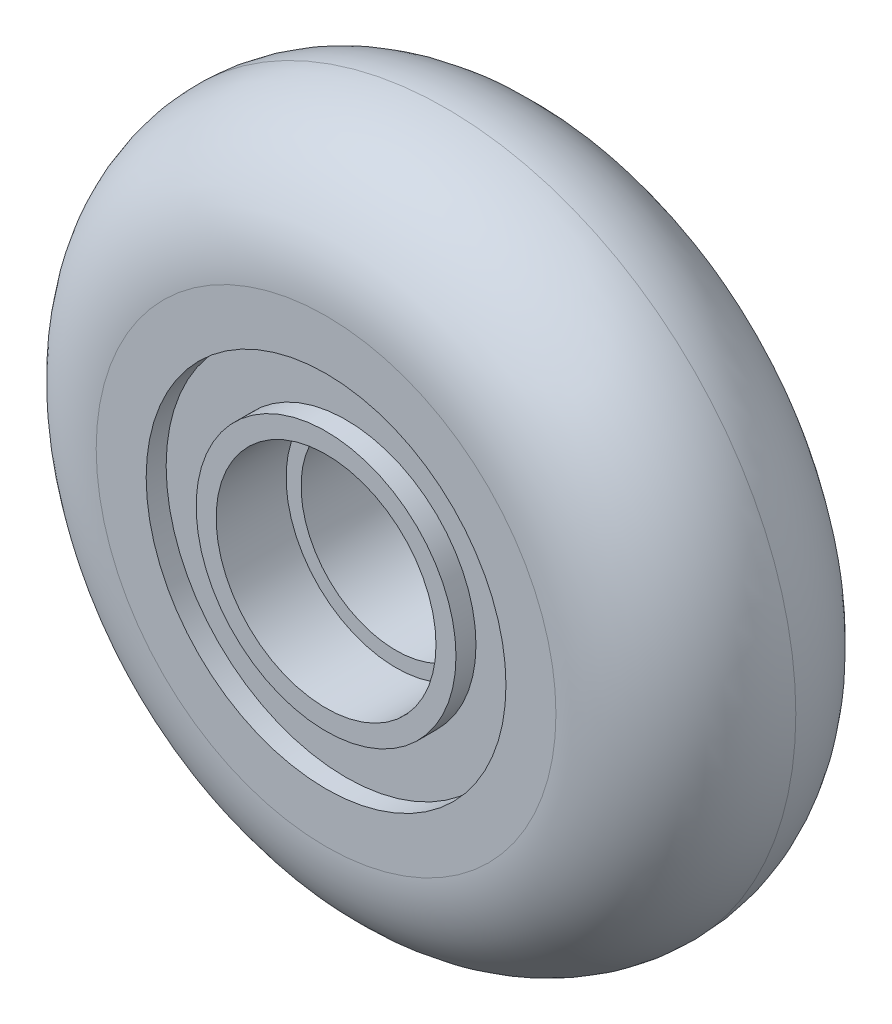
ISO-10303-21;
HEADER;
FILE_DESCRIPTION(('STEP AP214'),'2;1');
FILE_NAME('part.step','',(''),(''),'','','');
FILE_SCHEMA(('AUTOMOTIVE_DESIGN { 1 0 10303 214 1 1 1 1 }'));
ENDSEC;
DATA;
#1=APPLICATION_CONTEXT('core data for automotive mechanical design processes');
#2=APPLICATION_PROTOCOL_DEFINITION('international standard','automotive_design',2000,#1);
#3=PRODUCT_CONTEXT('',#1,'mechanical');
#4=PRODUCT('Part','Part','',(#3));
#5=PRODUCT_RELATED_PRODUCT_CATEGORY('part','',(#4));
#6=PRODUCT_DEFINITION_FORMATION('','',#4);
#7=PRODUCT_DEFINITION_CONTEXT('part definition',#1,'design');
#8=PRODUCT_DEFINITION('design','',#6,#7);
#9=PRODUCT_DEFINITION_SHAPE('','',#8);
#10=(LENGTH_UNIT() NAMED_UNIT(*) SI_UNIT(.MILLI.,.METRE.));
#11=(NAMED_UNIT(*) PLANE_ANGLE_UNIT() SI_UNIT($,.RADIAN.));
#12=(NAMED_UNIT(*) SI_UNIT($,.STERADIAN.) SOLID_ANGLE_UNIT());
#13=UNCERTAINTY_MEASURE_WITH_UNIT(LENGTH_MEASURE(1.E-05),#10,'distance_accuracy_value','');
#14=(GEOMETRIC_REPRESENTATION_CONTEXT(3) GLOBAL_UNCERTAINTY_ASSIGNED_CONTEXT((#13)) GLOBAL_UNIT_ASSIGNED_CONTEXT((#10,
#11,#12)) REPRESENTATION_CONTEXT('',''));
#15=CARTESIAN_POINT('',(0.,0.,0.));
#16=DIRECTION('',(0.,0.,1.));
#17=DIRECTION('',(1.,0.,0.));
#18=AXIS2_PLACEMENT_3D('',#15,#16,#17);
#19=CARTESIAN_POINT('',(0.,0.,24.));
#20=DIRECTION('',(0.,0.,1.));
#21=DIRECTION('',(1.,0.,0.));
#22=AXIS2_PLACEMENT_3D('',#19,#20,#21);
#23=PLANE('',#22);
#24=CARTESIAN_POINT('',(0.,0.,24.));
#25=DIRECTION('',(0.,0.,1.));
#26=DIRECTION('',(1.,0.,0.));
#27=AXIS2_PLACEMENT_3D('',#24,#25,#26);
#28=CIRCLE('',#27,11.);
#29=CARTESIAN_POINT('',(11.,0.,24.));
#30=VERTEX_POINT('',#29);
#31=EDGE_CURVE('E54',#30,#30,#28,.T.);
#32=ORIENTED_EDGE('',*,*,#31,.F.);
#33=EDGE_LOOP('',(#32));
#34=FACE_BOUND('',#33,.T.);
#35=CARTESIAN_POINT('',(0.,0.,24.));
#36=DIRECTION('',(0.,0.,1.));
#37=DIRECTION('',(1.,0.,0.));
#38=AXIS2_PLACEMENT_3D('',#35,#36,#37);
#39=CIRCLE('',#38,13.);
#40=CARTESIAN_POINT('',(13.,0.,24.));
#41=VERTEX_POINT('',#40);
#42=EDGE_CURVE('E87',#41,#41,#39,.T.);
#43=ORIENTED_EDGE('',*,*,#42,.T.);
#44=EDGE_LOOP('',(#43));
#45=FACE_BOUND('',#44,.T.);
#46=ADVANCED_FACE('F34',(#34,#45),#23,.T.);
#47=CARTESIAN_POINT('',(0.,0.,0.));
#48=DIRECTION('',(0.,0.,1.));
#49=DIRECTION('',(1.,0.,0.));
#50=AXIS2_PLACEMENT_3D('',#47,#48,#49);
#51=PLANE('',#50);
#52=CARTESIAN_POINT('',(0.,0.,0.));
#53=DIRECTION('',(0.,0.,-1.));
#54=DIRECTION('',(-1.,0.,0.));
#55=AXIS2_PLACEMENT_3D('',#52,#53,#54);
#56=CIRCLE('',#55,11.);
#57=CARTESIAN_POINT('',(-11.,0.,0.));
#58=VERTEX_POINT('',#57);
#59=EDGE_CURVE('E60',#58,#58,#56,.T.);
#60=ORIENTED_EDGE('',*,*,#59,.F.);
#61=EDGE_LOOP('',(#60));
#62=FACE_BOUND('',#61,.T.);
#63=CARTESIAN_POINT('',(0.,0.,0.));
#64=DIRECTION('',(0.,0.,-1.));
#65=DIRECTION('',(-1.,0.,0.));
#66=AXIS2_PLACEMENT_3D('',#63,#64,#65);
#67=CIRCLE('',#66,13.);
#68=CARTESIAN_POINT('',(-13.,0.,0.));
#69=VERTEX_POINT('',#68);
#70=EDGE_CURVE('E75',#69,#69,#67,.T.);
#71=ORIENTED_EDGE('',*,*,#70,.T.);
#72=EDGE_LOOP('',(#71));
#73=FACE_BOUND('',#72,.T.);
#74=ADVANCED_FACE('F104',(#62,#73),#51,.F.);
#75=CARTESIAN_POINT('',(0.,0.,24.));
#76=DIRECTION('',(0.,0.,1.));
#77=DIRECTION('',(1.,0.,0.));
#78=AXIS2_PLACEMENT_3D('',#75,#76,#77);
#79=CIRCLE('',#78,18.);
#80=CARTESIAN_POINT('',(18.,0.,24.));
#81=VERTEX_POINT('',#80);
#82=EDGE_CURVE('E81',#81,#81,#79,.T.);
#83=ORIENTED_EDGE('',*,*,#82,.F.);
#84=EDGE_LOOP('',(#83));
#85=FACE_BOUND('',#84,.T.);
#86=CARTESIAN_POINT('',(0.,0.,24.));
#87=DIRECTION('',(0.,0.,1.));
#88=DIRECTION('',(1.,0.,0.));
#89=AXIS2_PLACEMENT_3D('',#86,#87,#88);
#90=CIRCLE('',#89,23.);
#91=CARTESIAN_POINT('',(23.,0.,24.));
#92=VERTEX_POINT('',#91);
#93=EDGE_CURVE('E46',#92,#92,#90,.T.);
#94=ORIENTED_EDGE('',*,*,#93,.T.);
#95=EDGE_LOOP('',(#94));
#96=FACE_BOUND('',#95,.T.);
#97=ADVANCED_FACE('F36',(#85,#96),#23,.T.);
#98=CARTESIAN_POINT('',(0.,0.,0.));
#99=DIRECTION('',(0.,0.,-1.));
#100=DIRECTION('',(-1.,0.,0.));
#101=AXIS2_PLACEMENT_3D('',#98,#99,#100);
#102=CIRCLE('',#101,18.);
#103=CARTESIAN_POINT('',(-18.,0.,0.));
#104=VERTEX_POINT('',#103);
#105=EDGE_CURVE('E69',#104,#104,#102,.T.);
#106=ORIENTED_EDGE('',*,*,#105,.F.);
#107=EDGE_LOOP('',(#106));
#108=FACE_BOUND('',#107,.T.);
#109=CARTESIAN_POINT('',(0.,0.,0.));
#110=DIRECTION('',(0.,0.,1.));
#111=DIRECTION('',(1.,0.,0.));
#112=AXIS2_PLACEMENT_3D('',#109,#110,#111);
#113=CIRCLE('',#112,23.);
#114=CARTESIAN_POINT('',(23.,0.,0.));
#115=VERTEX_POINT('',#114);
#116=EDGE_CURVE('E11',#115,#115,#113,.F.);
#117=ORIENTED_EDGE('',*,*,#116,.T.);
#118=EDGE_LOOP('',(#117));
#119=FACE_BOUND('',#118,.T.);
#120=ADVANCED_FACE('F110',(#108,#119),#51,.F.);
#121=CARTESIAN_POINT('',(0.,0.,12.));
#122=DIRECTION('',(0.,0.,1.));
#123=DIRECTION('',(1.,0.,0.));
#124=AXIS2_PLACEMENT_3D('',#121,#122,#123);
#125=TOROIDAL_SURFACE('',#124,23.,12.);
#126=CARTESIAN_POINT('',(0.,0.,12.));
#127=DIRECTION('',(0.,0.,1.));
#128=DIRECTION('',(1.,0.,0.));
#129=AXIS2_PLACEMENT_3D('',#126,#127,#128);
#130=CIRCLE('',#129,35.);
#131=CARTESIAN_POINT('',(35.,0.,12.));
#132=VERTEX_POINT('',#131);
#133=EDGE_CURVE('E42',#132,#132,#130,.F.);
#134=ORIENTED_EDGE('',*,*,#133,.F.);
#135=EDGE_LOOP('',(#134));
#136=FACE_BOUND('',#135,.T.);
#137=ORIENTED_EDGE('',*,*,#93,.F.);
#138=EDGE_LOOP('',(#137));
#139=FACE_BOUND('',#138,.T.);
#140=ADVANCED_FACE('F117',(#136,#139),#125,.T.);
#141=CARTESIAN_POINT('',(0.,0.,12.));
#142=DIRECTION('',(0.,0.,1.));
#143=DIRECTION('',(1.,0.,0.));
#144=AXIS2_PLACEMENT_3D('',#141,#142,#143);
#145=TOROIDAL_SURFACE('',#144,23.,12.);
#146=ORIENTED_EDGE('',*,*,#116,.F.);
#147=EDGE_LOOP('',(#146));
#148=FACE_BOUND('',#147,.T.);
#149=ORIENTED_EDGE('',*,*,#133,.T.);
#150=EDGE_LOOP('',(#149));
#151=FACE_BOUND('',#150,.T.);
#152=ADVANCED_FACE('F124',(#148,#151),#145,.T.);
#153=CARTESIAN_POINT('',(0.,0.,17.));
#154=DIRECTION('',(0.,0.,1.));
#155=DIRECTION('',(1.,0.,0.));
#156=AXIS2_PLACEMENT_3D('',#153,#154,#155);
#157=CYLINDRICAL_SURFACE('',#156,11.);
#158=CARTESIAN_POINT('',(0.,0.,17.));
#159=DIRECTION('',(0.,0.,1.));
#160=DIRECTION('',(1.,0.,0.));
#161=AXIS2_PLACEMENT_3D('',#158,#159,#160);
#162=CIRCLE('',#161,11.);
#163=CARTESIAN_POINT('',(11.,0.,17.));
#164=VERTEX_POINT('',#163);
#165=EDGE_CURVE('E51',#164,#164,#162,.T.);
#166=ORIENTED_EDGE('',*,*,#165,.F.);
#167=EDGE_LOOP('',(#166));
#168=FACE_BOUND('',#167,.T.);
#169=ORIENTED_EDGE('',*,*,#31,.T.);
#170=EDGE_LOOP('',(#169));
#171=FACE_BOUND('',#170,.T.);
#172=ADVANCED_FACE('F130',(#168,#171),#157,.F.);
#173=CARTESIAN_POINT('',(0.,0.,17.));
#174=DIRECTION('',(0.,0.,1.));
#175=DIRECTION('',(1.,0.,0.));
#176=AXIS2_PLACEMENT_3D('',#173,#174,#175);
#177=PLANE('',#176);
#178=CARTESIAN_POINT('',(0.,0.,17.));
#179=DIRECTION('',(0.,0.,1.));
#180=DIRECTION('',(1.,0.,0.));
#181=AXIS2_PLACEMENT_3D('',#178,#179,#180);
#182=CIRCLE('',#181,9.5);
#183=CARTESIAN_POINT('',(9.5,0.,17.));
#184=VERTEX_POINT('',#183);
#185=EDGE_CURVE('E63',#184,#184,#182,.T.);
#186=ORIENTED_EDGE('',*,*,#185,.F.);
#187=EDGE_LOOP('',(#186));
#188=FACE_BOUND('',#187,.T.);
#189=ORIENTED_EDGE('',*,*,#165,.T.);
#190=EDGE_LOOP('',(#189));
#191=FACE_BOUND('',#190,.T.);
#192=ADVANCED_FACE('F137',(#188,#191),#177,.T.);
#193=CARTESIAN_POINT('',(0.,0.,7.));
#194=DIRECTION('',(0.,0.,-1.));
#195=DIRECTION('',(-1.,0.,0.));
#196=AXIS2_PLACEMENT_3D('',#193,#194,#195);
#197=CYLINDRICAL_SURFACE('',#196,11.);
#198=CARTESIAN_POINT('',(0.,0.,7.));
#199=DIRECTION('',(0.,0.,-1.));
#200=DIRECTION('',(-1.,0.,0.));
#201=AXIS2_PLACEMENT_3D('',#198,#199,#200);
#202=CIRCLE('',#201,11.);
#203=CARTESIAN_POINT('',(-11.,0.,7.));
#204=VERTEX_POINT('',#203);
#205=EDGE_CURVE('E57',#204,#204,#202,.T.);
#206=ORIENTED_EDGE('',*,*,#205,.F.);
#207=EDGE_LOOP('',(#206));
#208=FACE_BOUND('',#207,.T.);
#209=ORIENTED_EDGE('',*,*,#59,.T.);
#210=EDGE_LOOP('',(#209));
#211=FACE_BOUND('',#210,.T.);
#212=ADVANCED_FACE('F141',(#208,#211),#197,.F.);
#213=CARTESIAN_POINT('',(0.,0.,7.));
#214=DIRECTION('',(0.,0.,-1.));
#215=DIRECTION('',(-1.,0.,0.));
#216=AXIS2_PLACEMENT_3D('',#213,#214,#215);
#217=PLANE('',#216);
#218=CARTESIAN_POINT('',(0.,0.,7.));
#219=DIRECTION('',(0.,0.,-1.));
#220=DIRECTION('',(-1.,0.,0.));
#221=AXIS2_PLACEMENT_3D('',#218,#219,#220);
#222=CIRCLE('',#221,9.5);
#223=CARTESIAN_POINT('',(-9.5,0.,7.));
#224=VERTEX_POINT('',#223);
#225=EDGE_CURVE('E38',#224,#224,#222,.T.);
#226=ORIENTED_EDGE('',*,*,#225,.F.);
#227=EDGE_LOOP('',(#226));
#228=FACE_BOUND('',#227,.T.);
#229=ORIENTED_EDGE('',*,*,#205,.T.);
#230=EDGE_LOOP('',(#229));
#231=FACE_BOUND('',#230,.T.);
#232=ADVANCED_FACE('F145',(#228,#231),#217,.T.);
#233=CARTESIAN_POINT('',(0.,0.,0.));
#234=DIRECTION('',(0.,0.,1.));
#235=DIRECTION('',(1.,0.,0.));
#236=AXIS2_PLACEMENT_3D('',#233,#234,#235);
#237=CYLINDRICAL_SURFACE('',#236,9.5);
#238=ORIENTED_EDGE('',*,*,#225,.T.);
#239=EDGE_LOOP('',(#238));
#240=FACE_BOUND('',#239,.T.);
#241=ORIENTED_EDGE('',*,*,#185,.T.);
#242=EDGE_LOOP('',(#241));
#243=FACE_BOUND('',#242,.T.);
#244=ADVANCED_FACE('F149',(#240,#243),#237,.F.);
#245=CARTESIAN_POINT('',(0.,0.,2.));
#246=DIRECTION('',(0.,0.,-1.));
#247=DIRECTION('',(-1.,0.,0.));
#248=AXIS2_PLACEMENT_3D('',#245,#246,#247);
#249=CYLINDRICAL_SURFACE('',#248,18.);
#250=CARTESIAN_POINT('',(0.,0.,2.));
#251=DIRECTION('',(0.,0.,-1.));
#252=DIRECTION('',(-1.,0.,0.));
#253=AXIS2_PLACEMENT_3D('',#250,#251,#252);
#254=CIRCLE('',#253,18.);
#255=CARTESIAN_POINT('',(-18.,0.,2.));
#256=VERTEX_POINT('',#255);
#257=EDGE_CURVE('E66',#256,#256,#254,.T.);
#258=ORIENTED_EDGE('',*,*,#257,.F.);
#259=EDGE_LOOP('',(#258));
#260=FACE_BOUND('',#259,.T.);
#261=ORIENTED_EDGE('',*,*,#105,.T.);
#262=EDGE_LOOP('',(#261));
#263=FACE_BOUND('',#262,.T.);
#264=ADVANCED_FACE('F153',(#260,#263),#249,.F.);
#265=CARTESIAN_POINT('',(0.,0.,2.));
#266=DIRECTION('',(0.,0.,-1.));
#267=DIRECTION('',(-1.,0.,0.));
#268=AXIS2_PLACEMENT_3D('',#265,#266,#267);
#269=PLANE('',#268);
#270=CARTESIAN_POINT('',(0.,0.,2.));
#271=DIRECTION('',(0.,0.,-1.));
#272=DIRECTION('',(-1.,0.,0.));
#273=AXIS2_PLACEMENT_3D('',#270,#271,#272);
#274=CIRCLE('',#273,13.);
#275=CARTESIAN_POINT('',(-13.,0.,2.));
#276=VERTEX_POINT('',#275);
#277=EDGE_CURVE('E72',#276,#276,#274,.T.);
#278=ORIENTED_EDGE('',*,*,#277,.F.);
#279=EDGE_LOOP('',(#278));
#280=FACE_BOUND('',#279,.T.);
#281=ORIENTED_EDGE('',*,*,#257,.T.);
#282=EDGE_LOOP('',(#281));
#283=FACE_BOUND('',#282,.T.);
#284=ADVANCED_FACE('F157',(#280,#283),#269,.T.);
#285=CARTESIAN_POINT('',(0.,0.,2.));
#286=DIRECTION('',(0.,0.,-1.));
#287=DIRECTION('',(-1.,0.,0.));
#288=AXIS2_PLACEMENT_3D('',#285,#286,#287);
#289=CYLINDRICAL_SURFACE('',#288,13.);
#290=ORIENTED_EDGE('',*,*,#277,.T.);
#291=EDGE_LOOP('',(#290));
#292=FACE_BOUND('',#291,.T.);
#293=ORIENTED_EDGE('',*,*,#70,.F.);
#294=EDGE_LOOP('',(#293));
#295=FACE_BOUND('',#294,.T.);
#296=ADVANCED_FACE('F161',(#292,#295),#289,.T.);
#297=CARTESIAN_POINT('',(0.,0.,22.));
#298=DIRECTION('',(0.,0.,1.));
#299=DIRECTION('',(1.,0.,0.));
#300=AXIS2_PLACEMENT_3D('',#297,#298,#299);
#301=CYLINDRICAL_SURFACE('',#300,18.);
#302=CARTESIAN_POINT('',(0.,0.,22.));
#303=DIRECTION('',(0.,0.,1.));
#304=DIRECTION('',(1.,0.,0.));
#305=AXIS2_PLACEMENT_3D('',#302,#303,#304);
#306=CIRCLE('',#305,18.);
#307=CARTESIAN_POINT('',(18.,0.,22.));
#308=VERTEX_POINT('',#307);
#309=EDGE_CURVE('E78',#308,#308,#306,.T.);
#310=ORIENTED_EDGE('',*,*,#309,.F.);
#311=EDGE_LOOP('',(#310));
#312=FACE_BOUND('',#311,.T.);
#313=ORIENTED_EDGE('',*,*,#82,.T.);
#314=EDGE_LOOP('',(#313));
#315=FACE_BOUND('',#314,.T.);
#316=ADVANCED_FACE('F100',(#312,#315),#301,.F.);
#317=CARTESIAN_POINT('',(0.,0.,22.));
#318=DIRECTION('',(0.,0.,1.));
#319=DIRECTION('',(1.,0.,0.));
#320=AXIS2_PLACEMENT_3D('',#317,#318,#319);
#321=PLANE('',#320);
#322=CARTESIAN_POINT('',(0.,0.,22.));
#323=DIRECTION('',(0.,0.,1.));
#324=DIRECTION('',(1.,0.,0.));
#325=AXIS2_PLACEMENT_3D('',#322,#323,#324);
#326=CIRCLE('',#325,13.);
#327=CARTESIAN_POINT('',(13.,0.,22.));
#328=VERTEX_POINT('',#327);
#329=EDGE_CURVE('E84',#328,#328,#326,.T.);
#330=ORIENTED_EDGE('',*,*,#329,.F.);
#331=EDGE_LOOP('',(#330));
#332=FACE_BOUND('',#331,.T.);
#333=ORIENTED_EDGE('',*,*,#309,.T.);
#334=EDGE_LOOP('',(#333));
#335=FACE_BOUND('',#334,.T.);
#336=ADVANCED_FACE('F94',(#332,#335),#321,.T.);
#337=CARTESIAN_POINT('',(0.,0.,22.));
#338=DIRECTION('',(0.,0.,1.));
#339=DIRECTION('',(1.,0.,0.));
#340=AXIS2_PLACEMENT_3D('',#337,#338,#339);
#341=CYLINDRICAL_SURFACE('',#340,13.);
#342=ORIENTED_EDGE('',*,*,#329,.T.);
#343=EDGE_LOOP('',(#342));
#344=FACE_BOUND('',#343,.T.);
#345=ORIENTED_EDGE('',*,*,#42,.F.);
#346=EDGE_LOOP('',(#345));
#347=FACE_BOUND('',#346,.T.);
#348=ADVANCED_FACE('F92',(#344,#347),#341,.T.);
#349=CLOSED_SHELL('',(#46,#74,#97,#120,#140,#152,#172,#192,#212,#232,#244,#264,#284,#296,#316,
#336,#348));
#350=MANIFOLD_SOLID_BREP('B2',#349);
#351=ADVANCED_BREP_SHAPE_REPRESENTATION('',(#18,#350),#14);
#352=SHAPE_DEFINITION_REPRESENTATION(#9,#351);
ENDSEC;
END-ISO-10303-21;
